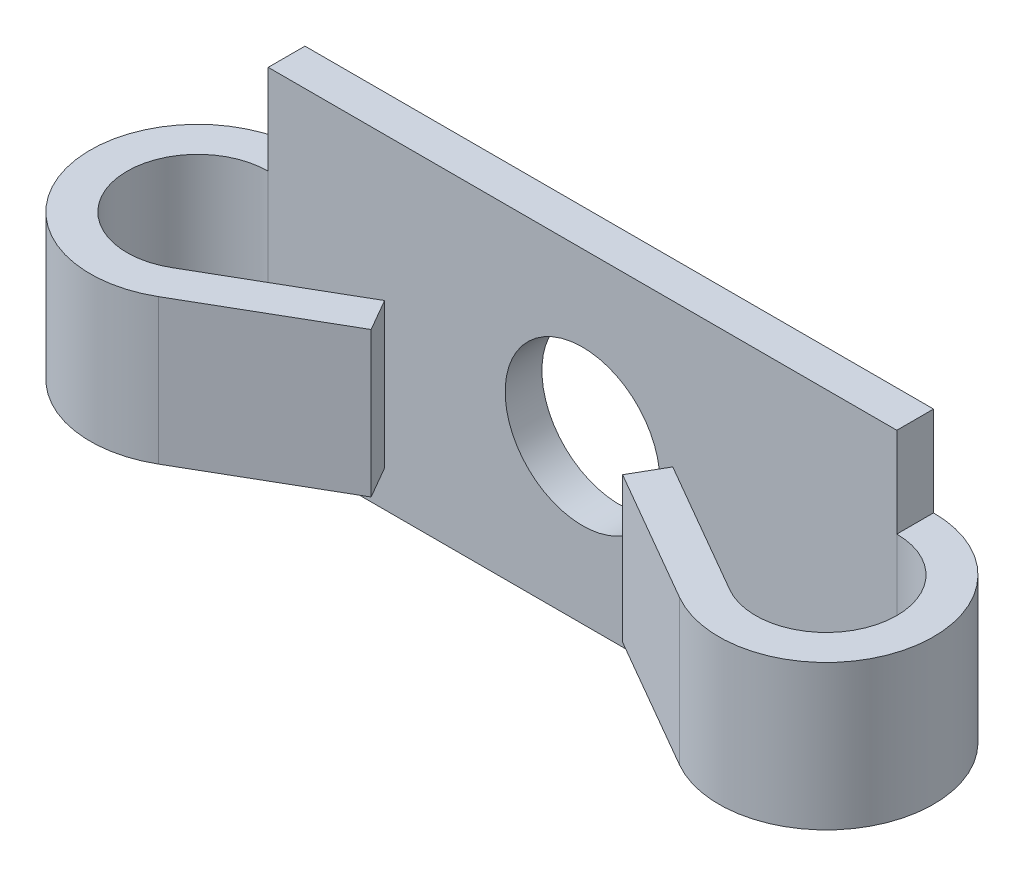
ISO-10303-21;
HEADER;
FILE_DESCRIPTION(('STEP AP214'),'2;1');
FILE_NAME('part.step','',(''),(''),'','','');
FILE_SCHEMA(('AUTOMOTIVE_DESIGN { 1 0 10303 214 1 1 1 1 }'));
ENDSEC;
DATA;
#1=APPLICATION_CONTEXT('core data for automotive mechanical design processes');
#2=APPLICATION_PROTOCOL_DEFINITION('international standard','automotive_design',2000,#1);
#3=PRODUCT_CONTEXT('',#1,'mechanical');
#4=PRODUCT('Part','Part','',(#3));
#5=PRODUCT_RELATED_PRODUCT_CATEGORY('part','',(#4));
#6=PRODUCT_DEFINITION_FORMATION('','',#4);
#7=PRODUCT_DEFINITION_CONTEXT('part definition',#1,'design');
#8=PRODUCT_DEFINITION('design','',#6,#7);
#9=PRODUCT_DEFINITION_SHAPE('','',#8);
#10=(LENGTH_UNIT() NAMED_UNIT(*) SI_UNIT(.MILLI.,.METRE.));
#11=(NAMED_UNIT(*) PLANE_ANGLE_UNIT() SI_UNIT($,.RADIAN.));
#12=(NAMED_UNIT(*) SI_UNIT($,.STERADIAN.) SOLID_ANGLE_UNIT());
#13=UNCERTAINTY_MEASURE_WITH_UNIT(LENGTH_MEASURE(1.E-05),#10,'distance_accuracy_value','');
#14=(GEOMETRIC_REPRESENTATION_CONTEXT(3) GLOBAL_UNCERTAINTY_ASSIGNED_CONTEXT((#13)) GLOBAL_UNIT_ASSIGNED_CONTEXT((#10,
#11,#12)) REPRESENTATION_CONTEXT('',''));
#15=CARTESIAN_POINT('',(0.,0.,0.));
#16=DIRECTION('',(0.,0.,1.));
#17=DIRECTION('',(1.,0.,0.));
#18=AXIS2_PLACEMENT_3D('',#15,#16,#17);
#19=CARTESIAN_POINT('',(16.25,-8.4,1.9));
#20=DIRECTION('',(-1.,0.,0.));
#21=DIRECTION('',(0.,0.,1.));
#22=AXIS2_PLACEMENT_3D('',#19,#20,#21);
#23=PLANE('',#22);
#24=DIRECTION('',(0.,0.,-1.));
#25=VECTOR('',#24,1.);
#26=CARTESIAN_POINT('',(16.25,-3.75,1.9));
#27=LINE('',#26,#25);
#28=CARTESIAN_POINT('',(16.25,-3.75,1.9));
#29=VERTEX_POINT('',#28);
#30=CARTESIAN_POINT('',(16.25,-3.75,0.));
#31=VERTEX_POINT('',#30);
#32=EDGE_CURVE('E58',#29,#31,#27,.T.);
#33=ORIENTED_EDGE('',*,*,#32,.F.);
#34=DIRECTION('',(0.,1.,0.));
#35=VECTOR('',#34,1.);
#36=CARTESIAN_POINT('',(16.25,-8.4,1.9));
#37=LINE('',#36,#35);
#38=CARTESIAN_POINT('',(16.25,-8.4,1.9));
#39=VERTEX_POINT('',#38);
#40=EDGE_CURVE('E258',#39,#29,#37,.T.);
#41=ORIENTED_EDGE('',*,*,#40,.F.);
#42=DIRECTION('',(0.,0.,-1.));
#43=VECTOR('',#42,1.);
#44=CARTESIAN_POINT('',(16.25,-8.4,1.9));
#45=LINE('',#44,#43);
#46=CARTESIAN_POINT('',(16.25,-8.4,0.));
#47=VERTEX_POINT('',#46);
#48=EDGE_CURVE('E268',#39,#47,#45,.T.);
#49=ORIENTED_EDGE('',*,*,#48,.T.);
#50=DIRECTION('',(0.,1.,0.));
#51=VECTOR('',#50,1.);
#52=CARTESIAN_POINT('',(16.25,-8.4,0.));
#53=LINE('',#52,#51);
#54=EDGE_CURVE('E269',#47,#31,#53,.T.);
#55=ORIENTED_EDGE('',*,*,#54,.T.);
#56=EDGE_LOOP('',(#33,#41,#49,#55));
#57=FACE_BOUND('',#56,.T.);
#58=ADVANCED_FACE('F35',(#57),#23,.F.);
#59=CARTESIAN_POINT('',(-16.25,-8.4,1.9));
#60=DIRECTION('',(1.,0.,0.));
#61=DIRECTION('',(0.,0.,-1.));
#62=AXIS2_PLACEMENT_3D('',#59,#60,#61);
#63=PLANE('',#62);
#64=DIRECTION('',(0.,0.,-1.));
#65=VECTOR('',#64,1.);
#66=CARTESIAN_POINT('',(-16.25,-3.75,1.9));
#67=LINE('',#66,#65);
#68=CARTESIAN_POINT('',(-16.25,-3.75,1.9));
#69=VERTEX_POINT('',#68);
#70=CARTESIAN_POINT('',(-16.25,-3.75,0.));
#71=VERTEX_POINT('',#70);
#72=EDGE_CURVE('E226',#69,#71,#67,.T.);
#73=ORIENTED_EDGE('',*,*,#72,.T.);
#74=DIRECTION('',(0.,-1.,0.));
#75=VECTOR('',#74,1.);
#76=CARTESIAN_POINT('',(-16.25,-8.4,0.));
#77=LINE('',#76,#75);
#78=CARTESIAN_POINT('',(-16.25,-8.4,0.));
#79=VERTEX_POINT('',#78);
#80=EDGE_CURVE('E273',#71,#79,#77,.T.);
#81=ORIENTED_EDGE('',*,*,#80,.T.);
#82=DIRECTION('',(0.,0.,-1.));
#83=VECTOR('',#82,1.);
#84=CARTESIAN_POINT('',(-16.25,-8.4,1.9));
#85=LINE('',#84,#83);
#86=CARTESIAN_POINT('',(-16.25,-8.4,1.9));
#87=VERTEX_POINT('',#86);
#88=EDGE_CURVE('E281',#87,#79,#85,.T.);
#89=ORIENTED_EDGE('',*,*,#88,.F.);
#90=DIRECTION('',(0.,-1.,0.));
#91=VECTOR('',#90,1.);
#92=CARTESIAN_POINT('',(-16.25,-8.4,1.9));
#93=LINE('',#92,#91);
#94=EDGE_CURVE('E262',#69,#87,#93,.T.);
#95=ORIENTED_EDGE('',*,*,#94,.F.);
#96=EDGE_LOOP('',(#73,#81,#89,#95));
#97=FACE_BOUND('',#96,.T.);
#98=ADVANCED_FACE('F352',(#97),#63,.F.);
#99=CARTESIAN_POINT('',(0.,0.,1.9));
#100=DIRECTION('',(0.,0.,-1.));
#101=DIRECTION('',(-1.,0.,0.));
#102=AXIS2_PLACEMENT_3D('',#99,#100,#101);
#103=PLANE('',#102);
#104=ORIENTED_EDGE('',*,*,#40,.T.);
#105=DIRECTION('',(0.,-1.,0.));
#106=VECTOR('',#105,1.);
#107=CARTESIAN_POINT('',(16.25,3.75,1.9));
#108=LINE('',#107,#106);
#109=CARTESIAN_POINT('',(16.25,3.75,1.9));
#110=VERTEX_POINT('',#109);
#111=EDGE_CURVE('E185',#110,#29,#108,.T.);
#112=ORIENTED_EDGE('',*,*,#111,.F.);
#113=CARTESIAN_POINT('',(16.25,8.4,1.9));
#114=VERTEX_POINT('',#113);
#115=EDGE_CURVE('E50',#110,#114,#37,.T.);
#116=ORIENTED_EDGE('',*,*,#115,.T.);
#117=DIRECTION('',(-1.,0.,0.));
#118=VECTOR('',#117,1.);
#119=CARTESIAN_POINT('',(-16.25,8.4,1.9));
#120=LINE('',#119,#118);
#121=CARTESIAN_POINT('',(-16.25,8.4,1.9));
#122=VERTEX_POINT('',#121);
#123=EDGE_CURVE('E260',#114,#122,#120,.T.);
#124=ORIENTED_EDGE('',*,*,#123,.T.);
#125=CARTESIAN_POINT('',(-16.25,3.75,1.9));
#126=VERTEX_POINT('',#125);
#127=EDGE_CURVE('E263',#122,#126,#93,.T.);
#128=ORIENTED_EDGE('',*,*,#127,.T.);
#129=DIRECTION('',(0.,-1.,0.));
#130=VECTOR('',#129,1.);
#131=CARTESIAN_POINT('',(-16.25,3.75,1.9));
#132=LINE('',#131,#130);
#133=EDGE_CURVE('E249',#126,#69,#132,.T.);
#134=ORIENTED_EDGE('',*,*,#133,.T.);
#135=ORIENTED_EDGE('',*,*,#94,.T.);
#136=DIRECTION('',(1.,0.,0.));
#137=VECTOR('',#136,1.);
#138=CARTESIAN_POINT('',(-16.25,-8.4,1.9));
#139=LINE('',#138,#137);
#140=EDGE_CURVE('E266',#87,#39,#139,.T.);
#141=ORIENTED_EDGE('',*,*,#140,.T.);
#142=EDGE_LOOP('',(#104,#112,#116,#124,#128,#134,#135,#141));
#143=FACE_BOUND('',#142,.T.);
#144=CARTESIAN_POINT('',(0.,0.,1.9));
#145=DIRECTION('',(0.,0.,1.));
#146=DIRECTION('',(1.,0.,0.));
#147=AXIS2_PLACEMENT_3D('',#144,#145,#146);
#148=CIRCLE('',#147,4.);
#149=CARTESIAN_POINT('',(4.,0.,1.9));
#150=VERTEX_POINT('',#149);
#151=EDGE_CURVE('E252',#150,#150,#148,.T.);
#152=ORIENTED_EDGE('',*,*,#151,.F.);
#153=EDGE_LOOP('',(#152));
#154=FACE_BOUND('',#153,.T.);
#155=ADVANCED_FACE('F326',(#143,#154),#103,.F.);
#156=CARTESIAN_POINT('',(0.,0.,0.));
#157=DIRECTION('',(0.,0.,-1.));
#158=DIRECTION('',(-1.,0.,0.));
#159=AXIS2_PLACEMENT_3D('',#156,#157,#158);
#160=PLANE('',#159);
#161=ORIENTED_EDGE('',*,*,#54,.F.);
#162=DIRECTION('',(1.,0.,0.));
#163=VECTOR('',#162,1.);
#164=CARTESIAN_POINT('',(-16.25,-8.4,0.));
#165=LINE('',#164,#163);
#166=EDGE_CURVE('E277',#79,#47,#165,.T.);
#167=ORIENTED_EDGE('',*,*,#166,.F.);
#168=ORIENTED_EDGE('',*,*,#80,.F.);
#169=DIRECTION('',(0.,-1.,0.));
#170=VECTOR('',#169,1.);
#171=CARTESIAN_POINT('',(-16.25,3.75,0.));
#172=LINE('',#171,#170);
#173=CARTESIAN_POINT('',(-16.25,3.75,0.));
#174=VERTEX_POINT('',#173);
#175=EDGE_CURVE('E246',#174,#71,#172,.T.);
#176=ORIENTED_EDGE('',*,*,#175,.F.);
#177=CARTESIAN_POINT('',(-16.25,8.4,0.));
#178=VERTEX_POINT('',#177);
#179=EDGE_CURVE('E274',#178,#174,#77,.T.);
#180=ORIENTED_EDGE('',*,*,#179,.F.);
#181=DIRECTION('',(-1.,0.,0.));
#182=VECTOR('',#181,1.);
#183=CARTESIAN_POINT('',(-16.25,8.4,0.));
#184=LINE('',#183,#182);
#185=CARTESIAN_POINT('',(16.25,8.4,0.));
#186=VERTEX_POINT('',#185);
#187=EDGE_CURVE('E271',#186,#178,#184,.T.);
#188=ORIENTED_EDGE('',*,*,#187,.F.);
#189=CARTESIAN_POINT('',(16.25,3.75,0.));
#190=VERTEX_POINT('',#189);
#191=EDGE_CURVE('E255',#190,#186,#53,.T.);
#192=ORIENTED_EDGE('',*,*,#191,.F.);
#193=DIRECTION('',(0.,-1.,0.));
#194=VECTOR('',#193,1.);
#195=CARTESIAN_POINT('',(16.25,3.75,0.));
#196=LINE('',#195,#194);
#197=EDGE_CURVE('E200',#190,#31,#196,.T.);
#198=ORIENTED_EDGE('',*,*,#197,.T.);
#199=EDGE_LOOP('',(#161,#167,#168,#176,#180,#188,#192,#198));
#200=FACE_BOUND('',#199,.T.);
#201=CARTESIAN_POINT('',(0.,0.,0.));
#202=DIRECTION('',(0.,0.,1.));
#203=DIRECTION('',(1.,0.,0.));
#204=AXIS2_PLACEMENT_3D('',#201,#202,#203);
#205=CIRCLE('',#204,4.);
#206=CARTESIAN_POINT('',(4.,0.,0.));
#207=VERTEX_POINT('',#206);
#208=EDGE_CURVE('E251',#207,#207,#205,.T.);
#209=ORIENTED_EDGE('',*,*,#208,.T.);
#210=EDGE_LOOP('',(#209));
#211=FACE_BOUND('',#210,.T.);
#212=ADVANCED_FACE('F294',(#200,#211),#160,.T.);
#213=ORIENTED_EDGE('',*,*,#115,.F.);
#214=DIRECTION('',(0.,0.,-1.));
#215=VECTOR('',#214,1.);
#216=CARTESIAN_POINT('',(16.25,3.75,1.9));
#217=LINE('',#216,#215);
#218=EDGE_CURVE('E171',#110,#190,#217,.T.);
#219=ORIENTED_EDGE('',*,*,#218,.T.);
#220=ORIENTED_EDGE('',*,*,#191,.T.);
#221=DIRECTION('',(0.,0.,-1.));
#222=VECTOR('',#221,1.);
#223=CARTESIAN_POINT('',(16.25,8.4,1.9));
#224=LINE('',#223,#222);
#225=EDGE_CURVE('E11',#114,#186,#224,.T.);
#226=ORIENTED_EDGE('',*,*,#225,.F.);
#227=EDGE_LOOP('',(#213,#219,#220,#226));
#228=FACE_BOUND('',#227,.T.);
#229=ADVANCED_FACE('F37',(#228),#23,.F.);
#230=CARTESIAN_POINT('',(-16.25,8.4,1.9));
#231=DIRECTION('',(0.,-1.,0.));
#232=DIRECTION('',(0.,0.,-1.));
#233=AXIS2_PLACEMENT_3D('',#230,#231,#232);
#234=PLANE('',#233);
#235=ORIENTED_EDGE('',*,*,#187,.T.);
#236=DIRECTION('',(0.,0.,-1.));
#237=VECTOR('',#236,1.);
#238=CARTESIAN_POINT('',(-16.25,8.4,1.9));
#239=LINE('',#238,#237);
#240=EDGE_CURVE('E43',#122,#178,#239,.T.);
#241=ORIENTED_EDGE('',*,*,#240,.F.);
#242=ORIENTED_EDGE('',*,*,#123,.F.);
#243=ORIENTED_EDGE('',*,*,#225,.T.);
#244=EDGE_LOOP('',(#235,#241,#242,#243));
#245=FACE_BOUND('',#244,.T.);
#246=ADVANCED_FACE('F329',(#245),#234,.F.);
#247=ORIENTED_EDGE('',*,*,#179,.T.);
#248=DIRECTION('',(0.,0.,-1.));
#249=VECTOR('',#248,1.);
#250=CARTESIAN_POINT('',(-16.25,3.75,1.9));
#251=LINE('',#250,#249);
#252=EDGE_CURVE('E211',#126,#174,#251,.T.);
#253=ORIENTED_EDGE('',*,*,#252,.F.);
#254=ORIENTED_EDGE('',*,*,#127,.F.);
#255=ORIENTED_EDGE('',*,*,#240,.T.);
#256=EDGE_LOOP('',(#247,#253,#254,#255));
#257=FACE_BOUND('',#256,.T.);
#258=ADVANCED_FACE('F288',(#257),#63,.F.);
#259=CARTESIAN_POINT('',(-16.25,-8.4,1.9));
#260=DIRECTION('',(0.,1.,0.));
#261=DIRECTION('',(0.,0.,1.));
#262=AXIS2_PLACEMENT_3D('',#259,#260,#261);
#263=PLANE('',#262);
#264=ORIENTED_EDGE('',*,*,#166,.T.);
#265=ORIENTED_EDGE('',*,*,#48,.F.);
#266=ORIENTED_EDGE('',*,*,#140,.F.);
#267=ORIENTED_EDGE('',*,*,#88,.T.);
#268=EDGE_LOOP('',(#264,#265,#266,#267));
#269=FACE_BOUND('',#268,.T.);
#270=ADVANCED_FACE('F370',(#269),#263,.F.);
#271=CARTESIAN_POINT('',(0.,0.,1.9));
#272=DIRECTION('',(0.,0.,-1.));
#273=DIRECTION('',(-1.,0.,0.));
#274=AXIS2_PLACEMENT_3D('',#271,#272,#273);
#275=CYLINDRICAL_SURFACE('',#274,4.);
#276=ORIENTED_EDGE('',*,*,#151,.T.);
#277=EDGE_LOOP('',(#276));
#278=FACE_BOUND('',#277,.T.);
#279=ORIENTED_EDGE('',*,*,#208,.F.);
#280=EDGE_LOOP('',(#279));
#281=FACE_BOUND('',#280,.T.);
#282=ADVANCED_FACE('F372',(#278,#281),#275,.F.);
#283=CARTESIAN_POINT('',(-16.25,3.75,5.55));
#284=DIRECTION('',(0.,-1.,0.));
#285=DIRECTION('',(0.,0.,-1.));
#286=AXIS2_PLACEMENT_3D('',#283,#284,#285);
#287=CYLINDRICAL_SURFACE('',#286,3.65);
#288=CARTESIAN_POINT('',(-16.25,-3.75,5.55));
#289=DIRECTION('',(0.,-1.,0.));
#290=DIRECTION('',(0.,0.,1.));
#291=AXIS2_PLACEMENT_3D('',#288,#289,#290);
#292=CIRCLE('',#291,3.65);
#293=CARTESIAN_POINT('',(-14.425,-3.75,8.71099272381321));
#294=VERTEX_POINT('',#293);
#295=EDGE_CURVE('E161',#294,#69,#292,.T.);
#296=ORIENTED_EDGE('',*,*,#295,.T.);
#297=ORIENTED_EDGE('',*,*,#133,.F.);
#298=CARTESIAN_POINT('',(-16.25,3.75,5.55));
#299=DIRECTION('',(0.,-1.,0.));
#300=DIRECTION('',(0.,0.,1.));
#301=AXIS2_PLACEMENT_3D('',#298,#299,#300);
#302=CIRCLE('',#301,3.65);
#303=CARTESIAN_POINT('',(-14.425,3.75,8.71099272381321));
#304=VERTEX_POINT('',#303);
#305=EDGE_CURVE('E208',#304,#126,#302,.T.);
#306=ORIENTED_EDGE('',*,*,#305,.F.);
#307=DIRECTION('',(0.,-1.,0.));
#308=VECTOR('',#307,1.);
#309=CARTESIAN_POINT('',(-14.425,3.75,8.71099272381321));
#310=LINE('',#309,#308);
#311=EDGE_CURVE('E223',#304,#294,#310,.T.);
#312=ORIENTED_EDGE('',*,*,#311,.T.);
#313=EDGE_LOOP('',(#296,#297,#306,#312));
#314=FACE_BOUND('',#313,.T.);
#315=ADVANCED_FACE('F391',(#314),#287,.F.);
#316=CARTESIAN_POINT('',(-16.25,3.75,5.55));
#317=DIRECTION('',(0.,-1.,0.));
#318=DIRECTION('',(0.,0.,-1.));
#319=AXIS2_PLACEMENT_3D('',#316,#317,#318);
#320=CYLINDRICAL_SURFACE('',#319,5.55);
#321=CARTESIAN_POINT('',(-16.25,-3.75,5.55));
#322=DIRECTION('',(0.,1.,0.));
#323=DIRECTION('',(0.,0.,1.));
#324=AXIS2_PLACEMENT_3D('',#321,#322,#323);
#325=CIRCLE('',#324,5.55);
#326=CARTESIAN_POINT('',(-13.475,-3.75,10.3564409910036));
#327=VERTEX_POINT('',#326);
#328=EDGE_CURVE('E228',#71,#327,#325,.T.);
#329=ORIENTED_EDGE('',*,*,#328,.T.);
#330=DIRECTION('',(0.,-1.,0.));
#331=VECTOR('',#330,1.);
#332=CARTESIAN_POINT('',(-13.475,3.75,10.3564409910036));
#333=LINE('',#332,#331);
#334=CARTESIAN_POINT('',(-13.475,3.75,10.3564409910036));
#335=VERTEX_POINT('',#334);
#336=EDGE_CURVE('E243',#335,#327,#333,.T.);
#337=ORIENTED_EDGE('',*,*,#336,.F.);
#338=CARTESIAN_POINT('',(-16.25,3.75,5.55));
#339=DIRECTION('',(0.,1.,0.));
#340=DIRECTION('',(0.,0.,1.));
#341=AXIS2_PLACEMENT_3D('',#338,#339,#340);
#342=CIRCLE('',#341,5.55);
#343=EDGE_CURVE('E215',#174,#335,#342,.T.);
#344=ORIENTED_EDGE('',*,*,#343,.F.);
#345=ORIENTED_EDGE('',*,*,#175,.T.);
#346=EDGE_LOOP('',(#329,#337,#344,#345));
#347=FACE_BOUND('',#346,.T.);
#348=ADVANCED_FACE('F302',(#347),#320,.T.);
#349=CARTESIAN_POINT('',(-6.5,3.75,6.32942286340605));
#350=DIRECTION('',(-0.499999999999995,0.,-0.866025403784442));
#351=DIRECTION('',(-0.866025403784442,0.,0.499999999999995));
#352=AXIS2_PLACEMENT_3D('',#349,#350,#351);
#353=PLANE('',#352);
#354=DIRECTION('',(0.866025403784442,0.,-0.499999999999995));
#355=VECTOR('',#354,1.);
#356=CARTESIAN_POINT('',(-6.5,-3.75,6.32942286340605));
#357=LINE('',#356,#355);
#358=CARTESIAN_POINT('',(-6.5,-3.75,6.32942286340605));
#359=VERTEX_POINT('',#358);
#360=EDGE_CURVE('E230',#327,#359,#357,.T.);
#361=ORIENTED_EDGE('',*,*,#360,.T.);
#362=DIRECTION('',(0.,-1.,0.));
#363=VECTOR('',#362,1.);
#364=CARTESIAN_POINT('',(-6.5,3.75,6.32942286340605));
#365=LINE('',#364,#363);
#366=CARTESIAN_POINT('',(-6.5,3.75,6.32942286340605));
#367=VERTEX_POINT('',#366);
#368=EDGE_CURVE('E240',#367,#359,#365,.T.);
#369=ORIENTED_EDGE('',*,*,#368,.F.);
#370=DIRECTION('',(0.866025403784442,0.,-0.499999999999995));
#371=VECTOR('',#370,1.);
#372=CARTESIAN_POINT('',(-6.5,3.75,6.32942286340605));
#373=LINE('',#372,#371);
#374=EDGE_CURVE('E217',#335,#367,#373,.T.);
#375=ORIENTED_EDGE('',*,*,#374,.F.);
#376=ORIENTED_EDGE('',*,*,#336,.T.);
#377=EDGE_LOOP('',(#361,#369,#375,#376));
#378=FACE_BOUND('',#377,.T.);
#379=ADVANCED_FACE('F313',(#378),#353,.F.);
#380=CARTESIAN_POINT('',(-7.44999999999999,3.75,4.68397459621561));
#381=DIRECTION('',(-0.866025403784441,0.,0.499999999999995));
#382=DIRECTION('',(0.499999999999995,0.,0.866025403784441));
#383=AXIS2_PLACEMENT_3D('',#380,#381,#382);
#384=PLANE('',#383);
#385=DIRECTION('',(-0.499999999999995,0.,-0.866025403784441));
#386=VECTOR('',#385,1.);
#387=CARTESIAN_POINT('',(-7.44999999999999,-3.75,4.68397459621561));
#388=LINE('',#387,#386);
#389=CARTESIAN_POINT('',(-7.44999999999999,-3.75,4.68397459621561));
#390=VERTEX_POINT('',#389);
#391=EDGE_CURVE('E232',#359,#390,#388,.T.);
#392=ORIENTED_EDGE('',*,*,#391,.T.);
#393=DIRECTION('',(0.,-1.,0.));
#394=VECTOR('',#393,1.);
#395=CARTESIAN_POINT('',(-7.44999999999999,3.75,4.68397459621561));
#396=LINE('',#395,#394);
#397=CARTESIAN_POINT('',(-7.44999999999999,3.75,4.68397459621561));
#398=VERTEX_POINT('',#397);
#399=EDGE_CURVE('E237',#398,#390,#396,.T.);
#400=ORIENTED_EDGE('',*,*,#399,.F.);
#401=DIRECTION('',(-0.499999999999995,0.,-0.866025403784441));
#402=VECTOR('',#401,1.);
#403=CARTESIAN_POINT('',(-7.44999999999999,3.75,4.68397459621561));
#404=LINE('',#403,#402);
#405=EDGE_CURVE('E219',#367,#398,#404,.T.);
#406=ORIENTED_EDGE('',*,*,#405,.F.);
#407=ORIENTED_EDGE('',*,*,#368,.T.);
#408=EDGE_LOOP('',(#392,#400,#406,#407));
#409=FACE_BOUND('',#408,.T.);
#410=ADVANCED_FACE('F317',(#409),#384,.F.);
#411=CARTESIAN_POINT('',(-14.425,3.75,8.71099272381321));
#412=DIRECTION('',(0.499999999999995,0.,0.866025403784442));
#413=DIRECTION('',(0.866025403784442,0.,-0.499999999999995));
#414=AXIS2_PLACEMENT_3D('',#411,#412,#413);
#415=PLANE('',#414);
#416=DIRECTION('',(-0.866025403784441,0.,0.499999999999995));
#417=VECTOR('',#416,1.);
#418=CARTESIAN_POINT('',(-14.425,-3.75,8.71099272381321));
#419=LINE('',#418,#417);
#420=EDGE_CURVE('E212',#390,#294,#419,.T.);
#421=ORIENTED_EDGE('',*,*,#420,.T.);
#422=ORIENTED_EDGE('',*,*,#311,.F.);
#423=DIRECTION('',(-0.866025403784441,0.,0.499999999999995));
#424=VECTOR('',#423,1.);
#425=CARTESIAN_POINT('',(-14.425,3.75,8.71099272381321));
#426=LINE('',#425,#424);
#427=EDGE_CURVE('E221',#398,#304,#426,.T.);
#428=ORIENTED_EDGE('',*,*,#427,.F.);
#429=ORIENTED_EDGE('',*,*,#399,.T.);
#430=EDGE_LOOP('',(#421,#422,#428,#429));
#431=FACE_BOUND('',#430,.T.);
#432=ADVANCED_FACE('F416',(#431),#415,.F.);
#433=CARTESIAN_POINT('',(-16.25,3.75,5.55));
#434=DIRECTION('',(0.,1.,0.));
#435=DIRECTION('',(0.,0.,1.));
#436=AXIS2_PLACEMENT_3D('',#433,#434,#435);
#437=PLANE('',#436);
#438=ORIENTED_EDGE('',*,*,#305,.T.);
#439=ORIENTED_EDGE('',*,*,#252,.T.);
#440=ORIENTED_EDGE('',*,*,#343,.T.);
#441=ORIENTED_EDGE('',*,*,#374,.T.);
#442=ORIENTED_EDGE('',*,*,#405,.T.);
#443=ORIENTED_EDGE('',*,*,#427,.T.);
#444=EDGE_LOOP('',(#438,#439,#440,#441,#442,#443));
#445=FACE_BOUND('',#444,.T.);
#446=ADVANCED_FACE('F321',(#445),#437,.T.);
#447=CARTESIAN_POINT('',(-16.25,-3.75,5.55));
#448=DIRECTION('',(0.,1.,0.));
#449=DIRECTION('',(0.,0.,1.));
#450=AXIS2_PLACEMENT_3D('',#447,#448,#449);
#451=PLANE('',#450);
#452=ORIENTED_EDGE('',*,*,#295,.F.);
#453=ORIENTED_EDGE('',*,*,#420,.F.);
#454=ORIENTED_EDGE('',*,*,#391,.F.);
#455=ORIENTED_EDGE('',*,*,#360,.F.);
#456=ORIENTED_EDGE('',*,*,#328,.F.);
#457=ORIENTED_EDGE('',*,*,#72,.F.);
#458=EDGE_LOOP('',(#452,#453,#454,#455,#456,#457));
#459=FACE_BOUND('',#458,.T.);
#460=ADVANCED_FACE('F308',(#459),#451,.F.);
#461=CARTESIAN_POINT('',(16.25,3.75,5.55));
#462=DIRECTION('',(0.,-1.,0.));
#463=DIRECTION('',(0.,0.,-1.));
#464=AXIS2_PLACEMENT_3D('',#461,#462,#463);
#465=CYLINDRICAL_SURFACE('',#464,3.65);
#466=CARTESIAN_POINT('',(16.25,-3.75,5.55));
#467=DIRECTION('',(0.,1.,0.));
#468=DIRECTION('',(0.,0.,1.));
#469=AXIS2_PLACEMENT_3D('',#466,#467,#468);
#470=CIRCLE('',#469,3.65);
#471=CARTESIAN_POINT('',(14.425,-3.75,8.71099272381321));
#472=VERTEX_POINT('',#471);
#473=EDGE_CURVE('E156',#472,#29,#470,.T.);
#474=ORIENTED_EDGE('',*,*,#473,.F.);
#475=DIRECTION('',(0.,-1.,0.));
#476=VECTOR('',#475,1.);
#477=CARTESIAN_POINT('',(14.425,3.75,8.71099272381321));
#478=LINE('',#477,#476);
#479=CARTESIAN_POINT('',(14.425,3.75,8.71099272381321));
#480=VERTEX_POINT('',#479);
#481=EDGE_CURVE('E149',#480,#472,#478,.T.);
#482=ORIENTED_EDGE('',*,*,#481,.F.);
#483=CARTESIAN_POINT('',(16.25,3.75,5.55));
#484=DIRECTION('',(0.,1.,0.));
#485=DIRECTION('',(0.,0.,1.));
#486=AXIS2_PLACEMENT_3D('',#483,#484,#485);
#487=CIRCLE('',#486,3.65);
#488=EDGE_CURVE('E153',#480,#110,#487,.T.);
#489=ORIENTED_EDGE('',*,*,#488,.T.);
#490=ORIENTED_EDGE('',*,*,#111,.T.);
#491=EDGE_LOOP('',(#474,#482,#489,#490));
#492=FACE_BOUND('',#491,.T.);
#493=ADVANCED_FACE('F151',(#492),#465,.F.);
#494=CARTESIAN_POINT('',(14.425,3.75,8.71099272381321));
#495=DIRECTION('',(0.499999999999995,0.,-0.866025403784442));
#496=DIRECTION('',(-0.866025403784442,0.,-0.499999999999995));
#497=AXIS2_PLACEMENT_3D('',#494,#495,#496);
#498=PLANE('',#497);
#499=DIRECTION('',(0.866025403784441,0.,0.499999999999995));
#500=VECTOR('',#499,1.);
#501=CARTESIAN_POINT('',(14.425,-3.75,8.71099272381321));
#502=LINE('',#501,#500);
#503=CARTESIAN_POINT('',(7.44999999999999,-3.75,4.68397459621561));
#504=VERTEX_POINT('',#503);
#505=EDGE_CURVE('E187',#504,#472,#502,.T.);
#506=ORIENTED_EDGE('',*,*,#505,.F.);
#507=DIRECTION('',(0.,-1.,0.));
#508=VECTOR('',#507,1.);
#509=CARTESIAN_POINT('',(7.44999999999999,3.75,4.68397459621561));
#510=LINE('',#509,#508);
#511=CARTESIAN_POINT('',(7.44999999999999,3.75,4.68397459621561));
#512=VERTEX_POINT('',#511);
#513=EDGE_CURVE('E162',#512,#504,#510,.T.);
#514=ORIENTED_EDGE('',*,*,#513,.F.);
#515=DIRECTION('',(0.866025403784441,0.,0.499999999999995));
#516=VECTOR('',#515,1.);
#517=CARTESIAN_POINT('',(14.425,3.75,8.71099272381321));
#518=LINE('',#517,#516);
#519=EDGE_CURVE('E168',#512,#480,#518,.T.);
#520=ORIENTED_EDGE('',*,*,#519,.T.);
#521=ORIENTED_EDGE('',*,*,#481,.T.);
#522=EDGE_LOOP('',(#506,#514,#520,#521));
#523=FACE_BOUND('',#522,.T.);
#524=ADVANCED_FACE('F173',(#523),#498,.T.);
#525=CARTESIAN_POINT('',(7.44999999999999,3.75,4.68397459621561));
#526=DIRECTION('',(-0.866025403784441,0.,-0.499999999999995));
#527=DIRECTION('',(-0.499999999999995,0.,0.866025403784441));
#528=AXIS2_PLACEMENT_3D('',#525,#526,#527);
#529=PLANE('',#528);
#530=DIRECTION('',(0.499999999999995,0.,-0.866025403784441));
#531=VECTOR('',#530,1.);
#532=CARTESIAN_POINT('',(7.44999999999999,-3.75,4.68397459621561));
#533=LINE('',#532,#531);
#534=CARTESIAN_POINT('',(6.5,-3.75,6.32942286340605));
#535=VERTEX_POINT('',#534);
#536=EDGE_CURVE('E189',#535,#504,#533,.T.);
#537=ORIENTED_EDGE('',*,*,#536,.F.);
#538=DIRECTION('',(0.,-1.,0.));
#539=VECTOR('',#538,1.);
#540=CARTESIAN_POINT('',(6.5,3.75,6.32942286340605));
#541=LINE('',#540,#539);
#542=CARTESIAN_POINT('',(6.5,3.75,6.32942286340605));
#543=VERTEX_POINT('',#542);
#544=EDGE_CURVE('E205',#543,#535,#541,.T.);
#545=ORIENTED_EDGE('',*,*,#544,.F.);
#546=DIRECTION('',(0.499999999999995,0.,-0.866025403784441));
#547=VECTOR('',#546,1.);
#548=CARTESIAN_POINT('',(7.44999999999999,3.75,4.68397459621561));
#549=LINE('',#548,#547);
#550=EDGE_CURVE('E174',#543,#512,#549,.T.);
#551=ORIENTED_EDGE('',*,*,#550,.T.);
#552=ORIENTED_EDGE('',*,*,#513,.T.);
#553=EDGE_LOOP('',(#537,#545,#551,#552));
#554=FACE_BOUND('',#553,.T.);
#555=ADVANCED_FACE('F342',(#554),#529,.T.);
#556=CARTESIAN_POINT('',(6.5,3.75,6.32942286340605));
#557=DIRECTION('',(-0.499999999999995,0.,0.866025403784442));
#558=DIRECTION('',(0.866025403784442,0.,0.499999999999995));
#559=AXIS2_PLACEMENT_3D('',#556,#557,#558);
#560=PLANE('',#559);
#561=DIRECTION('',(-0.866025403784442,0.,-0.499999999999995));
#562=VECTOR('',#561,1.);
#563=CARTESIAN_POINT('',(6.5,-3.75,6.32942286340605));
#564=LINE('',#563,#562);
#565=CARTESIAN_POINT('',(13.475,-3.75,10.3564409910036));
#566=VERTEX_POINT('',#565);
#567=EDGE_CURVE('E192',#566,#535,#564,.T.);
#568=ORIENTED_EDGE('',*,*,#567,.F.);
#569=DIRECTION('',(0.,-1.,0.));
#570=VECTOR('',#569,1.);
#571=CARTESIAN_POINT('',(13.475,3.75,10.3564409910036));
#572=LINE('',#571,#570);
#573=CARTESIAN_POINT('',(13.475,3.75,10.3564409910036));
#574=VERTEX_POINT('',#573);
#575=EDGE_CURVE('E203',#574,#566,#572,.T.);
#576=ORIENTED_EDGE('',*,*,#575,.F.);
#577=DIRECTION('',(-0.866025403784442,0.,-0.499999999999995));
#578=VECTOR('',#577,1.);
#579=CARTESIAN_POINT('',(6.5,3.75,6.32942286340605));
#580=LINE('',#579,#578);
#581=EDGE_CURVE('E176',#574,#543,#580,.T.);
#582=ORIENTED_EDGE('',*,*,#581,.T.);
#583=ORIENTED_EDGE('',*,*,#544,.T.);
#584=EDGE_LOOP('',(#568,#576,#582,#583));
#585=FACE_BOUND('',#584,.T.);
#586=ADVANCED_FACE('F337',(#585),#560,.T.);
#587=CARTESIAN_POINT('',(16.25,3.75,5.55));
#588=DIRECTION('',(0.,-1.,0.));
#589=DIRECTION('',(0.,0.,-1.));
#590=AXIS2_PLACEMENT_3D('',#587,#588,#589);
#591=CYLINDRICAL_SURFACE('',#590,5.55);
#592=CARTESIAN_POINT('',(16.25,-3.75,5.55));
#593=DIRECTION('',(0.,-1.,0.));
#594=DIRECTION('',(0.,0.,1.));
#595=AXIS2_PLACEMENT_3D('',#592,#593,#594);
#596=CIRCLE('',#595,5.55);
#597=EDGE_CURVE('E195',#31,#566,#596,.T.);
#598=ORIENTED_EDGE('',*,*,#597,.F.);
#599=ORIENTED_EDGE('',*,*,#197,.F.);
#600=CARTESIAN_POINT('',(16.25,3.75,5.55));
#601=DIRECTION('',(0.,-1.,0.));
#602=DIRECTION('',(0.,0.,1.));
#603=AXIS2_PLACEMENT_3D('',#600,#601,#602);
#604=CIRCLE('',#603,5.55);
#605=EDGE_CURVE('E181',#190,#574,#604,.T.);
#606=ORIENTED_EDGE('',*,*,#605,.T.);
#607=ORIENTED_EDGE('',*,*,#575,.T.);
#608=EDGE_LOOP('',(#598,#599,#606,#607));
#609=FACE_BOUND('',#608,.T.);
#610=ADVANCED_FACE('F333',(#609),#591,.T.);
#611=CARTESIAN_POINT('',(16.25,3.75,5.55));
#612=DIRECTION('',(0.,1.,0.));
#613=DIRECTION('',(0.,0.,1.));
#614=AXIS2_PLACEMENT_3D('',#611,#612,#613);
#615=PLANE('',#614);
#616=ORIENTED_EDGE('',*,*,#488,.F.);
#617=ORIENTED_EDGE('',*,*,#519,.F.);
#618=ORIENTED_EDGE('',*,*,#550,.F.);
#619=ORIENTED_EDGE('',*,*,#581,.F.);
#620=ORIENTED_EDGE('',*,*,#605,.F.);
#621=ORIENTED_EDGE('',*,*,#218,.F.);
#622=EDGE_LOOP('',(#616,#617,#618,#619,#620,#621));
#623=FACE_BOUND('',#622,.T.);
#624=ADVANCED_FACE('F166',(#623),#615,.T.);
#625=CARTESIAN_POINT('',(16.25,-3.75,5.55));
#626=DIRECTION('',(0.,1.,0.));
#627=DIRECTION('',(0.,0.,1.));
#628=AXIS2_PLACEMENT_3D('',#625,#626,#627);
#629=PLANE('',#628);
#630=ORIENTED_EDGE('',*,*,#473,.T.);
#631=ORIENTED_EDGE('',*,*,#32,.T.);
#632=ORIENTED_EDGE('',*,*,#597,.T.);
#633=ORIENTED_EDGE('',*,*,#567,.T.);
#634=ORIENTED_EDGE('',*,*,#536,.T.);
#635=ORIENTED_EDGE('',*,*,#505,.T.);
#636=EDGE_LOOP('',(#630,#631,#632,#633,#634,#635));
#637=FACE_BOUND('',#636,.T.);
#638=ADVANCED_FACE('F340',(#637),#629,.F.);
#639=CLOSED_SHELL('',(#58,#98,#155,#212,#229,#246,#258,#270,#282,#315,#348,#379,#410,#432,#446,
#460,#493,#524,#555,#586,#610,#624,#638));
#640=MANIFOLD_SOLID_BREP('B2',#639);
#641=ADVANCED_BREP_SHAPE_REPRESENTATION('',(#18,#640),#14);
#642=SHAPE_DEFINITION_REPRESENTATION(#9,#641);
ENDSEC;
END-ISO-10303-21;
